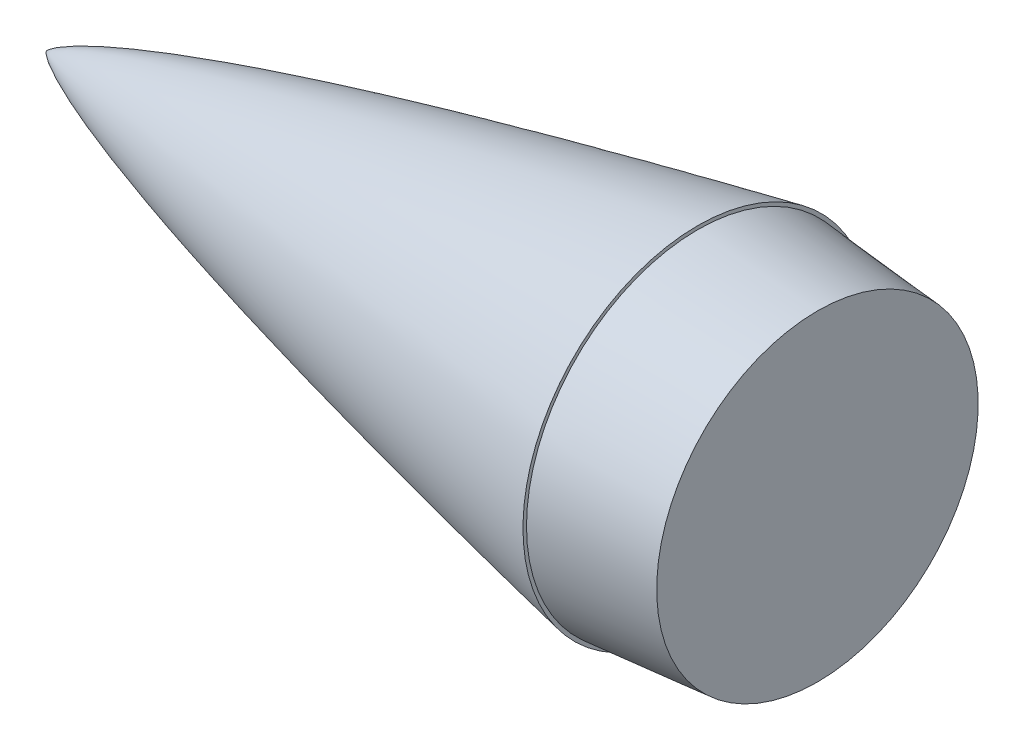
ISO-10303-21;
HEADER;
FILE_DESCRIPTION(('STEP AP214'),'2;1');
FILE_NAME('part.step','',(''),(''),'','','');
FILE_SCHEMA(('AUTOMOTIVE_DESIGN { 1 0 10303 214 1 1 1 1 }'));
ENDSEC;
DATA;
#1=APPLICATION_CONTEXT('core data for automotive mechanical design processes');
#2=APPLICATION_PROTOCOL_DEFINITION('international standard','automotive_design',2000,#1);
#3=PRODUCT_CONTEXT('',#1,'mechanical');
#4=PRODUCT('Part','Part','',(#3));
#5=PRODUCT_RELATED_PRODUCT_CATEGORY('part','',(#4));
#6=PRODUCT_DEFINITION_FORMATION('','',#4);
#7=PRODUCT_DEFINITION_CONTEXT('part definition',#1,'design');
#8=PRODUCT_DEFINITION('design','',#6,#7);
#9=PRODUCT_DEFINITION_SHAPE('','',#8);
#10=(LENGTH_UNIT() NAMED_UNIT(*) SI_UNIT(.MILLI.,.METRE.));
#11=(NAMED_UNIT(*) PLANE_ANGLE_UNIT() SI_UNIT($,.RADIAN.));
#12=(NAMED_UNIT(*) SI_UNIT($,.STERADIAN.) SOLID_ANGLE_UNIT());
#13=UNCERTAINTY_MEASURE_WITH_UNIT(LENGTH_MEASURE(1.E-05),#10,'distance_accuracy_value','');
#14=(GEOMETRIC_REPRESENTATION_CONTEXT(3) GLOBAL_UNCERTAINTY_ASSIGNED_CONTEXT((#13)) GLOBAL_UNIT_ASSIGNED_CONTEXT((#10,
#11,#12)) REPRESENTATION_CONTEXT('',''));
#15=CARTESIAN_POINT('',(0.,0.,0.));
#16=DIRECTION('',(0.,0.,1.));
#17=DIRECTION('',(1.,0.,0.));
#18=AXIS2_PLACEMENT_3D('',#15,#16,#17);
#19=CARTESIAN_POINT('',(-382.8,0.,0.));
#20=DIRECTION('',(1.,0.,0.));
#21=DIRECTION('',(0.,1.,0.));
#22=AXIS2_PLACEMENT_3D('',#19,#20,#21);
#23=PLANE('',#22);
#24=CARTESIAN_POINT('',(-382.8,0.,0.));
#25=DIRECTION('',(1.,0.,0.));
#26=DIRECTION('',(0.,1.,0.));
#27=AXIS2_PLACEMENT_3D('',#24,#25,#26);
#28=CIRCLE('',#27,7.15);
#29=CARTESIAN_POINT('',(-382.8,7.14999999999999,0.));
#30=VERTEX_POINT('',#29);
#31=EDGE_CURVE('E89',#30,#30,#28,.T.);
#32=ORIENTED_EDGE('',*,*,#31,.F.);
#33=EDGE_LOOP('',(#32));
#34=FACE_BOUND('',#33,.T.);
#35=CARTESIAN_POINT('',(-382.8,0.,0.));
#36=DIRECTION('',(1.,0.,0.));
#37=DIRECTION('',(0.,1.,0.));
#38=AXIS2_PLACEMENT_3D('',#35,#36,#37);
#39=CIRCLE('',#38,7.29726862571316);
#40=CARTESIAN_POINT('',(-382.8,7.29726862571316,0.));
#41=VERTEX_POINT('',#40);
#42=EDGE_CURVE('E12',#41,#41,#39,.T.);
#43=ORIENTED_EDGE('',*,*,#42,.T.);
#44=EDGE_LOOP('',(#43));
#45=FACE_BOUND('',#44,.T.);
#46=ADVANCED_FACE('F53',(#34,#45),#23,.T.);
#47=CARTESIAN_POINT('',(-410.,0.,0.));
#48=CARTESIAN_POINT('',(-409.996104343043,0.00976449689902335,0.));
#49=CARTESIAN_POINT('',(-409.985913153418,0.0279490747308062,0.));
#50=CARTESIAN_POINT('',(-409.957510571321,0.0594143028533337,0.));
#51=CARTESIAN_POINT('',(-409.898233487542,0.1142062146289,0.));
#52=CARTESIAN_POINT('',(-409.810537783304,0.17997009781727,0.));
#53=CARTESIAN_POINT('',(-409.676312366164,0.268169047261745,0.));
#54=CARTESIAN_POINT('',(-409.483787304396,0.379593537014922,0.));
#55=CARTESIAN_POINT('',(-409.212469031522,0.520885741333323,0.));
#56=CARTESIAN_POINT('',(-408.782228647582,0.722476645427516,0.));
#57=CARTESIAN_POINT('',(-408.0633328169,1.0244307263994,0.));
#58=CARTESIAN_POINT('',(-406.779619929941,1.50191951752579,0.));
#59=CARTESIAN_POINT('',(-404.418121727855,2.27068301003079,0.));
#60=CARTESIAN_POINT('',(-399.978466323839,3.52052425605253,0.));
#61=CARTESIAN_POINT('',(-392.218905514589,5.39313292092806,0.));
#62=CARTESIAN_POINT('',(-378.99508553227,8.1370308474546,0.));
#63=CARTESIAN_POINT('',(-360.816525388513,11.3764095789632,0.));
#64=CARTESIAN_POINT('',(-338.763877653047,14.8393803736611,0.));
#65=CARTESIAN_POINT('',(-314.22344301603,18.2908227784008,0.));
#66=CARTESIAN_POINT('',(-289.643356302951,21.4445876627348,0.));
#67=CARTESIAN_POINT('',(-265.032848706303,24.3508964604943,0.));
#68=CARTESIAN_POINT('',(-240.397990380166,27.0419167523867,0.));
#69=CARTESIAN_POINT('',(-215.742482431709,29.5365124328329,0.));
#70=CARTESIAN_POINT('',(-191.069036766365,31.8465331230353,0.));
#71=CARTESIAN_POINT('',(-166.37945951932,33.977380219421,0.));
#72=CARTESIAN_POINT('',(-141.675128405846,35.9296378563137,0.));
#73=CARTESIAN_POINT('',(-120.046737987028,37.4772955508728,0.));
#74=CARTESIAN_POINT('',(-101.499875990423,38.6821930104554,0.));
#75=CARTESIAN_POINT('',(-86.0387820796336,39.5986846871677,0.));
#76=CARTESIAN_POINT('',(-73.6667078642432,40.2757568211507,0.));
#77=CARTESIAN_POINT('',(-61.2914278422817,40.891966910061,0.));
#78=CARTESIAN_POINT('',(-50.4602491167538,41.3719286432088,0.));
#79=CARTESIAN_POINT('',(-41.1743618881754,41.734883373498,0.));
#80=CARTESIAN_POINT('',(-33.7119783029498,41.990289016737,0.));
#81=CARTESIAN_POINT('',(-28.0740328307755,42.1616169192843,0.));
#82=CARTESIAN_POINT('',(-23.348213609555,42.2851869219609,0.));
#83=CARTESIAN_POINT('',(-19.5348329703601,42.3707970808382,0.));
#84=CARTESIAN_POINT('',(-16.3567770901304,42.4293425512698,0.));
#85=CARTESIAN_POINT('',(-13.8141878860374,42.4697024103388,0.));
#86=CARTESIAN_POINT('',(-11.9071370262904,42.4885808321882,0.));
#87=CARTESIAN_POINT('',(-10.6357205008744,42.5,0.));
#88=CARTESIAN_POINT('',(-10.,42.5,0.));
#89=B_SPLINE_CURVE_WITH_KNOTS('',4,(#47,#48,#49,#50,#51,#52,#53,#54,#55,#56,#57,#58,#59,#60,#61,
#62,#63,#64,#65,#66,#67,#68,#69,#70,#71,#72,#73,#74,#75,#76,#77,#78,#79,#80,#81,#82,#83,#84,#85,
#86,#87,#88),.UNSPECIFIED.,.F.,.F.,(5,1,1,1,1,1,1,1,1,1,1,1,1,1,1,1,1,1,1,1,1,1,1,1,1,1,1,1,1,1,
1,1,1,1,1,1,1,1,5),(0.,0.000103976649997164,0.000207953299994328,0.000415906599988656,
0.000802400832158779,0.0011888950643289,0.00180194634259952,0.00262226433761093,
0.00383760912219115,0.00590297682370642,0.00953833140140297,0.0162115071217174,
0.0284781652553806,0.0516657978335034,0.0887424461283376,0.150226816133671,0.21171149926333,
0.273196105735341,0.334680800715612,0.39616535123727,0.457649954473699,0.519134577796471,
0.580619208254549,0.642103779420138,0.703588442284778,0.765073031966271,0.795815244440737,
0.826557456915203,0.857299729388856,0.888042001862508,0.918784365418666,0.934155547196744,
0.949526728974823,0.962145046731117,0.974763364487412,0.981072523365559,0.987381682243706,
0.993690841121853,1.),.UNSPECIFIED.);
#90=CARTESIAN_POINT('',(-393.098004326676,0.,0.));
#91=DIRECTION('',(1.,0.,0.));
#92=AXIS1_PLACEMENT('',#90,#91);
#93=SURFACE_OF_REVOLUTION('',#89,#92);
#94=CARTESIAN_POINT('',(-410.,0.,0.));
#95=VERTEX_POINT('',#94);
#96=VERTEX_LOOP('',#95);
#97=FACE_BOUND('',#96,.T.);
#98=ORIENTED_EDGE('',*,*,#42,.F.);
#99=EDGE_LOOP('',(#98));
#100=FACE_BOUND('',#99,.T.);
#101=ADVANCED_FACE('F55',(#97,#100),#93,.T.);
#102=CARTESIAN_POINT('',(-377.8,0.,0.));
#103=DIRECTION('',(1.,0.,0.));
#104=DIRECTION('',(0.,1.,0.));
#105=AXIS2_PLACEMENT_3D('',#102,#103,#104);
#106=PLANE('',#105);
#107=CARTESIAN_POINT('',(-377.8,0.,0.));
#108=DIRECTION('',(1.,0.,0.));
#109=DIRECTION('',(0.,1.,0.));
#110=AXIS2_PLACEMENT_3D('',#107,#108,#109);
#111=CIRCLE('',#110,6.71255668237038);
#112=CARTESIAN_POINT('',(-377.8,6.71255668237037,0.));
#113=VERTEX_POINT('',#112);
#114=EDGE_CURVE('E64',#113,#113,#111,.T.);
#115=ORIENTED_EDGE('',*,*,#114,.T.);
#116=EDGE_LOOP('',(#115));
#117=FACE_BOUND('',#116,.T.);
#118=ADVANCED_FACE('F69',(#117),#106,.T.);
#119=CARTESIAN_POINT('',(-382.8,0.,0.));
#120=DIRECTION('',(-1.,0.,0.));
#121=DIRECTION('',(0.,1.,0.));
#122=AXIS2_PLACEMENT_3D('',#119,#120,#121);
#123=CONICAL_SURFACE('',#122,7.15,0.0872664625997167);
#124=ORIENTED_EDGE('',*,*,#114,.F.);
#125=EDGE_LOOP('',(#124));
#126=FACE_BOUND('',#125,.T.);
#127=ORIENTED_EDGE('',*,*,#31,.T.);
#128=EDGE_LOOP('',(#127));
#129=FACE_BOUND('',#128,.T.);
#130=ADVANCED_FACE('F78',(#126,#129),#123,.T.);
#131=CLOSED_SHELL('',(#46,#101,#118,#130));
#132=MANIFOLD_SOLID_BREP('B2',#131);
#133=ADVANCED_BREP_SHAPE_REPRESENTATION('',(#18,#132),#14);
#134=SHAPE_DEFINITION_REPRESENTATION(#9,#133);
ENDSEC;
END-ISO-10303-21;
